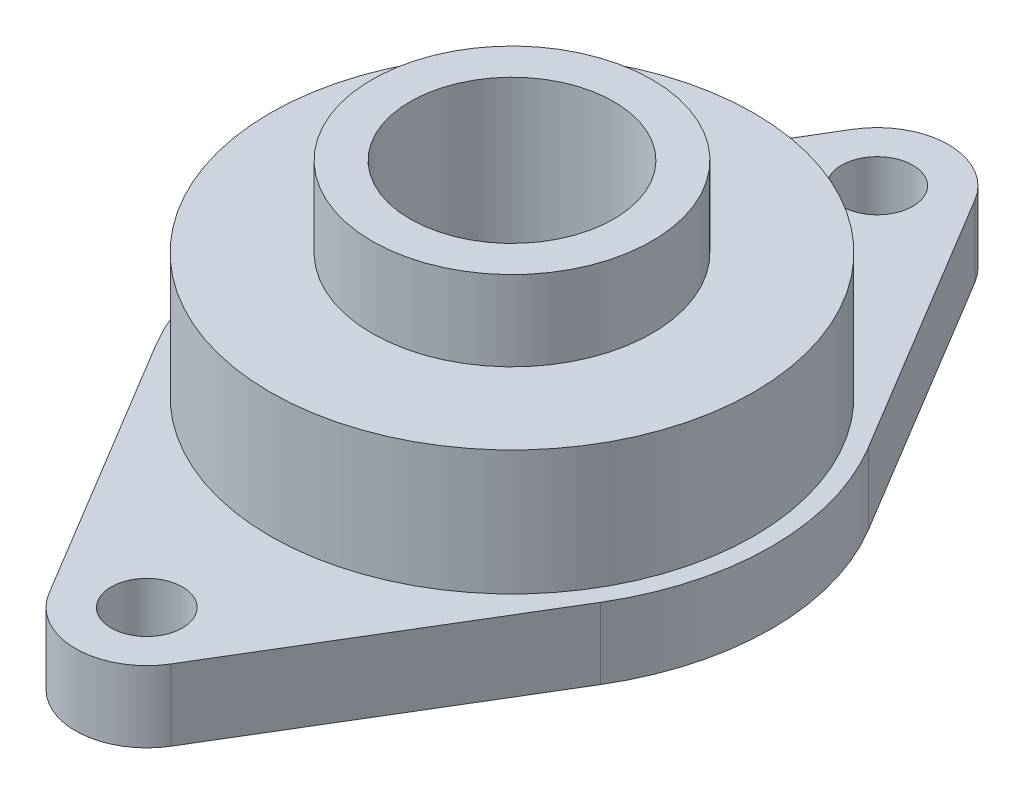
ISO-10303-21;
HEADER;
FILE_DESCRIPTION(('STEP AP214'),'2;1');
FILE_NAME('part.step','',(''),(''),'','','');
FILE_SCHEMA(('AUTOMOTIVE_DESIGN { 1 0 10303 214 1 1 1 1 }'));
ENDSEC;
DATA;
#1=APPLICATION_CONTEXT('core data for automotive mechanical design processes');
#2=APPLICATION_PROTOCOL_DEFINITION('international standard','automotive_design',2000,#1);
#3=PRODUCT_CONTEXT('',#1,'mechanical');
#4=PRODUCT('Part','Part','',(#3));
#5=PRODUCT_RELATED_PRODUCT_CATEGORY('part','',(#4));
#6=PRODUCT_DEFINITION_FORMATION('','',#4);
#7=PRODUCT_DEFINITION_CONTEXT('part definition',#1,'design');
#8=PRODUCT_DEFINITION('design','',#6,#7);
#9=PRODUCT_DEFINITION_SHAPE('','',#8);
#10=(LENGTH_UNIT() NAMED_UNIT(*) SI_UNIT(.MILLI.,.METRE.));
#11=(NAMED_UNIT(*) PLANE_ANGLE_UNIT() SI_UNIT($,.RADIAN.));
#12=(NAMED_UNIT(*) SI_UNIT($,.STERADIAN.) SOLID_ANGLE_UNIT());
#13=UNCERTAINTY_MEASURE_WITH_UNIT(LENGTH_MEASURE(1.E-05),#10,'distance_accuracy_value','');
#14=(GEOMETRIC_REPRESENTATION_CONTEXT(3) GLOBAL_UNCERTAINTY_ASSIGNED_CONTEXT((#13)) GLOBAL_UNIT_ASSIGNED_CONTEXT((#10,
#11,#12)) REPRESENTATION_CONTEXT('',''));
#15=CARTESIAN_POINT('',(0.,0.,0.));
#16=DIRECTION('',(0.,0.,1.));
#17=DIRECTION('',(1.,0.,0.));
#18=AXIS2_PLACEMENT_3D('',#15,#16,#17);
#19=CARTESIAN_POINT('',(0.,38.5,0.));
#20=DIRECTION('',(0.,1.,0.));
#21=DIRECTION('',(0.,0.,1.));
#22=AXIS2_PLACEMENT_3D('',#19,#20,#21);
#23=PLANE('',#22);
#24=CARTESIAN_POINT('',(0.,38.5,0.));
#25=DIRECTION('',(0.,1.,0.));
#26=DIRECTION('',(0.,0.,1.));
#27=AXIS2_PLACEMENT_3D('',#24,#25,#26);
#28=CIRCLE('',#27,47.5);
#29=CARTESIAN_POINT('',(0.,38.5,47.5));
#30=VERTEX_POINT('',#29);
#31=EDGE_CURVE('E141',#30,#30,#28,.T.);
#32=ORIENTED_EDGE('',*,*,#31,.T.);
#33=EDGE_LOOP('',(#32));
#34=FACE_BOUND('',#33,.T.);
#35=CARTESIAN_POINT('',(0.,38.5,0.));
#36=DIRECTION('',(0.,1.,0.));
#37=DIRECTION('',(0.,0.,1.));
#38=AXIS2_PLACEMENT_3D('',#35,#36,#37);
#39=CIRCLE('',#38,27.5);
#40=CARTESIAN_POINT('',(0.,38.5,27.5));
#41=VERTEX_POINT('',#40);
#42=EDGE_CURVE('E206',#41,#41,#39,.T.);
#43=ORIENTED_EDGE('',*,*,#42,.F.);
#44=EDGE_LOOP('',(#43));
#45=FACE_BOUND('',#44,.T.);
#46=ADVANCED_FACE('F35',(#34,#45),#23,.T.);
#47=CARTESIAN_POINT('',(0.,14.,0.));
#48=DIRECTION('',(0.,1.,0.));
#49=DIRECTION('',(0.,0.,1.));
#50=AXIS2_PLACEMENT_3D('',#47,#48,#49);
#51=PLANE('',#50);
#52=CARTESIAN_POINT('',(0.,14.,71.75));
#53=DIRECTION('',(0.,1.,0.));
#54=DIRECTION('',(0.,0.,1.));
#55=AXIS2_PLACEMENT_3D('',#52,#53,#54);
#56=CIRCLE('',#55,6.99999999999999);
#57=CARTESIAN_POINT('',(0.,14.,78.75));
#58=VERTEX_POINT('',#57);
#59=EDGE_CURVE('E134',#58,#58,#56,.F.);
#60=ORIENTED_EDGE('',*,*,#59,.T.);
#61=EDGE_LOOP('',(#60));
#62=FACE_BOUND('',#61,.T.);
#63=CARTESIAN_POINT('',(0.,14.,-71.75));
#64=DIRECTION('',(0.,1.,0.));
#65=DIRECTION('',(0.,0.,1.));
#66=AXIS2_PLACEMENT_3D('',#63,#64,#65);
#67=CIRCLE('',#66,7.);
#68=CARTESIAN_POINT('',(0.,14.,-64.75));
#69=VERTEX_POINT('',#68);
#70=EDGE_CURVE('E127',#69,#69,#67,.T.);
#71=ORIENTED_EDGE('',*,*,#70,.F.);
#72=EDGE_LOOP('',(#71));
#73=FACE_BOUND('',#72,.T.);
#74=DIRECTION('',(0.51567944250871,0.,0.856781601444561));
#75=VECTOR('',#74,1.);
#76=CARTESIAN_POINT('',(43.6958616736726,14.,-26.2996515679442));
#77=LINE('',#76,#75);
#78=CARTESIAN_POINT('',(11.9949424202239,14.,-78.9695121951219));
#79=VERTEX_POINT('',#78);
#80=CARTESIAN_POINT('',(43.6958616736726,14.,-26.2996515679442));
#81=VERTEX_POINT('',#80);
#82=EDGE_CURVE('E163',#79,#81,#77,.T.);
#83=ORIENTED_EDGE('',*,*,#82,.F.);
#84=CARTESIAN_POINT('',(0.,14.,-71.75));
#85=DIRECTION('',(0.,1.,0.));
#86=DIRECTION('',(0.,0.,1.));
#87=AXIS2_PLACEMENT_3D('',#84,#85,#86);
#88=CIRCLE('',#87,14.);
#89=CARTESIAN_POINT('',(-11.9949424202239,14.,-78.9695121951219));
#90=VERTEX_POINT('',#89);
#91=EDGE_CURVE('E194',#79,#90,#88,.T.);
#92=ORIENTED_EDGE('',*,*,#91,.T.);
#93=DIRECTION('',(0.515679442508711,0.,-0.85678160144456));
#94=VECTOR('',#93,1.);
#95=CARTESIAN_POINT('',(-43.6958616736726,14.,-26.2996515679443));
#96=LINE('',#95,#94);
#97=CARTESIAN_POINT('',(-43.6958616736726,14.,-26.2996515679442));
#98=VERTEX_POINT('',#97);
#99=EDGE_CURVE('E177',#98,#90,#96,.T.);
#100=ORIENTED_EDGE('',*,*,#99,.F.);
#101=CARTESIAN_POINT('',(0.,14.,0.));
#102=DIRECTION('',(0.,1.,0.));
#103=DIRECTION('',(0.,0.,1.));
#104=AXIS2_PLACEMENT_3D('',#101,#102,#103);
#105=CIRCLE('',#104,51.);
#106=CARTESIAN_POINT('',(-43.6958616736726,14.,26.2996515679442));
#107=VERTEX_POINT('',#106);
#108=EDGE_CURVE('E129',#98,#107,#105,.T.);
#109=ORIENTED_EDGE('',*,*,#108,.T.);
#110=DIRECTION('',(0.515679442508711,0.,0.85678160144456));
#111=VECTOR('',#110,1.);
#112=CARTESIAN_POINT('',(-43.6958616736726,14.,26.2996515679443));
#113=LINE('',#112,#111);
#114=CARTESIAN_POINT('',(-11.9949424202239,14.,78.9695121951219));
#115=VERTEX_POINT('',#114);
#116=EDGE_CURVE('E113',#107,#115,#113,.T.);
#117=ORIENTED_EDGE('',*,*,#116,.T.);
#118=CARTESIAN_POINT('',(0.,14.,71.75));
#119=DIRECTION('',(0.,1.,0.));
#120=DIRECTION('',(0.,0.,1.));
#121=AXIS2_PLACEMENT_3D('',#118,#119,#120);
#122=CIRCLE('',#121,14.);
#123=CARTESIAN_POINT('',(11.9949424202239,14.,78.9695121951219));
#124=VERTEX_POINT('',#123);
#125=EDGE_CURVE('E106',#115,#124,#122,.T.);
#126=ORIENTED_EDGE('',*,*,#125,.T.);
#127=DIRECTION('',(0.51567944250871,0.,-0.856781601444561));
#128=VECTOR('',#127,1.);
#129=CARTESIAN_POINT('',(43.6958616736726,14.,26.2996515679442));
#130=LINE('',#129,#128);
#131=CARTESIAN_POINT('',(43.6958616736726,14.,26.2996515679442));
#132=VERTEX_POINT('',#131);
#133=EDGE_CURVE('E111',#124,#132,#130,.T.);
#134=ORIENTED_EDGE('',*,*,#133,.T.);
#135=EDGE_CURVE('E52',#132,#81,#105,.T.);
#136=ORIENTED_EDGE('',*,*,#135,.T.);
#137=EDGE_LOOP('',(#83,#92,#100,#109,#117,#126,#134,#136));
#138=FACE_BOUND('',#137,.T.);
#139=CARTESIAN_POINT('',(0.,14.,0.));
#140=DIRECTION('',(0.,1.,0.));
#141=DIRECTION('',(0.,0.,1.));
#142=AXIS2_PLACEMENT_3D('',#139,#140,#141);
#143=CIRCLE('',#142,47.5);
#144=CARTESIAN_POINT('',(0.,14.,47.5));
#145=VERTEX_POINT('',#144);
#146=EDGE_CURVE('E197',#145,#145,#143,.T.);
#147=ORIENTED_EDGE('',*,*,#146,.F.);
#148=EDGE_LOOP('',(#147));
#149=FACE_BOUND('',#148,.T.);
#150=ADVANCED_FACE('F108',(#62,#73,#138,#149),#51,.T.);
#151=CARTESIAN_POINT('',(43.6958616736726,14.,-26.2996515679442));
#152=DIRECTION('',(0.856781601444561,0.,-0.51567944250871));
#153=DIRECTION('',(-0.51567944250871,0.,-0.856781601444561));
#154=AXIS2_PLACEMENT_3D('',#151,#152,#153);
#155=PLANE('',#154);
#156=DIRECTION('',(0.51567944250871,0.,0.856781601444561));
#157=VECTOR('',#156,1.);
#158=CARTESIAN_POINT('',(43.6958616736726,0.,-26.2996515679442));
#159=LINE('',#158,#157);
#160=CARTESIAN_POINT('',(11.9949424202239,0.,-78.9695121951219));
#161=VERTEX_POINT('',#160);
#162=CARTESIAN_POINT('',(43.6958616736726,0.,-26.2996515679442));
#163=VERTEX_POINT('',#162);
#164=EDGE_CURVE('E137',#161,#163,#159,.T.);
#165=ORIENTED_EDGE('',*,*,#164,.F.);
#166=DIRECTION('',(0.,-1.,0.));
#167=VECTOR('',#166,1.);
#168=CARTESIAN_POINT('',(11.9949424202239,14.,-78.9695121951219));
#169=LINE('',#168,#167);
#170=EDGE_CURVE('E12',#79,#161,#169,.T.);
#171=ORIENTED_EDGE('',*,*,#170,.F.);
#172=ORIENTED_EDGE('',*,*,#82,.T.);
#173=DIRECTION('',(0.,-1.,0.));
#174=VECTOR('',#173,1.);
#175=CARTESIAN_POINT('',(43.6958616736726,14.,-26.2996515679442));
#176=LINE('',#175,#174);
#177=EDGE_CURVE('E87',#81,#163,#176,.T.);
#178=ORIENTED_EDGE('',*,*,#177,.T.);
#179=EDGE_LOOP('',(#165,#171,#172,#178));
#180=FACE_BOUND('',#179,.T.);
#181=ADVANCED_FACE('F37',(#180),#155,.T.);
#182=CARTESIAN_POINT('',(0.,14.,-71.75));
#183=DIRECTION('',(0.,-1.,0.));
#184=DIRECTION('',(0.,0.,-1.));
#185=AXIS2_PLACEMENT_3D('',#182,#183,#184);
#186=CYLINDRICAL_SURFACE('',#185,14.);
#187=CARTESIAN_POINT('',(0.,0.,-71.75));
#188=DIRECTION('',(0.,1.,0.));
#189=DIRECTION('',(0.,0.,1.));
#190=AXIS2_PLACEMENT_3D('',#187,#188,#189);
#191=CIRCLE('',#190,14.);
#192=CARTESIAN_POINT('',(-11.9949424202239,0.,-78.9695121951219));
#193=VERTEX_POINT('',#192);
#194=EDGE_CURVE('E140',#161,#193,#191,.T.);
#195=ORIENTED_EDGE('',*,*,#194,.T.);
#196=DIRECTION('',(0.,-1.,0.));
#197=VECTOR('',#196,1.);
#198=CARTESIAN_POINT('',(-11.9949424202239,14.,-78.9695121951219));
#199=LINE('',#198,#197);
#200=EDGE_CURVE('E44',#90,#193,#199,.T.);
#201=ORIENTED_EDGE('',*,*,#200,.F.);
#202=ORIENTED_EDGE('',*,*,#91,.F.);
#203=ORIENTED_EDGE('',*,*,#170,.T.);
#204=EDGE_LOOP('',(#195,#201,#202,#203));
#205=FACE_BOUND('',#204,.T.);
#206=ADVANCED_FACE('F180',(#205),#186,.T.);
#207=CARTESIAN_POINT('',(-43.6958616736726,14.,-26.2996515679443));
#208=DIRECTION('',(-0.85678160144456,0.,-0.515679442508711));
#209=DIRECTION('',(-0.515679442508711,0.,0.85678160144456));
#210=AXIS2_PLACEMENT_3D('',#207,#208,#209);
#211=PLANE('',#210);
#212=DIRECTION('',(0.515679442508711,0.,-0.85678160144456));
#213=VECTOR('',#212,1.);
#214=CARTESIAN_POINT('',(-43.6958616736726,0.,-26.2996515679443));
#215=LINE('',#214,#213);
#216=CARTESIAN_POINT('',(-43.6958616736726,0.,-26.2996515679442));
#217=VERTEX_POINT('',#216);
#218=EDGE_CURVE('E144',#217,#193,#215,.T.);
#219=ORIENTED_EDGE('',*,*,#218,.F.);
#220=DIRECTION('',(0.,-1.,0.));
#221=VECTOR('',#220,1.);
#222=CARTESIAN_POINT('',(-43.6958616736726,14.,-26.2996515679442));
#223=LINE('',#222,#221);
#224=EDGE_CURVE('E170',#98,#217,#223,.T.);
#225=ORIENTED_EDGE('',*,*,#224,.F.);
#226=ORIENTED_EDGE('',*,*,#99,.T.);
#227=ORIENTED_EDGE('',*,*,#200,.T.);
#228=EDGE_LOOP('',(#219,#225,#226,#227));
#229=FACE_BOUND('',#228,.T.);
#230=ADVANCED_FACE('F175',(#229),#211,.T.);
#231=CARTESIAN_POINT('',(0.,14.,0.));
#232=DIRECTION('',(0.,-1.,0.));
#233=DIRECTION('',(0.,0.,-1.));
#234=AXIS2_PLACEMENT_3D('',#231,#232,#233);
#235=CYLINDRICAL_SURFACE('',#234,51.);
#236=CARTESIAN_POINT('',(0.,0.,0.));
#237=DIRECTION('',(0.,1.,0.));
#238=DIRECTION('',(0.,0.,1.));
#239=AXIS2_PLACEMENT_3D('',#236,#237,#238);
#240=CIRCLE('',#239,51.);
#241=CARTESIAN_POINT('',(-43.6958616736726,0.,26.2996515679442));
#242=VERTEX_POINT('',#241);
#243=EDGE_CURVE('E147',#217,#242,#240,.T.);
#244=ORIENTED_EDGE('',*,*,#243,.T.);
#245=DIRECTION('',(0.,-1.,0.));
#246=VECTOR('',#245,1.);
#247=CARTESIAN_POINT('',(-43.6958616736726,14.,26.2996515679442));
#248=LINE('',#247,#246);
#249=EDGE_CURVE('E167',#107,#242,#248,.T.);
#250=ORIENTED_EDGE('',*,*,#249,.F.);
#251=ORIENTED_EDGE('',*,*,#108,.F.);
#252=ORIENTED_EDGE('',*,*,#224,.T.);
#253=EDGE_LOOP('',(#244,#250,#251,#252));
#254=FACE_BOUND('',#253,.T.);
#255=ADVANCED_FACE('F188',(#254),#235,.T.);
#256=CARTESIAN_POINT('',(-43.6958616736726,14.,26.2996515679443));
#257=DIRECTION('',(0.85678160144456,0.,-0.515679442508711));
#258=DIRECTION('',(-0.515679442508711,0.,-0.85678160144456));
#259=AXIS2_PLACEMENT_3D('',#256,#257,#258);
#260=PLANE('',#259);
#261=DIRECTION('',(0.515679442508711,0.,0.85678160144456));
#262=VECTOR('',#261,1.);
#263=CARTESIAN_POINT('',(-43.6958616736726,0.,26.2996515679443));
#264=LINE('',#263,#262);
#265=CARTESIAN_POINT('',(-11.9949424202239,0.,78.9695121951219));
#266=VERTEX_POINT('',#265);
#267=EDGE_CURVE('E149',#242,#266,#264,.T.);
#268=ORIENTED_EDGE('',*,*,#267,.T.);
#269=DIRECTION('',(0.,-1.,0.));
#270=VECTOR('',#269,1.);
#271=CARTESIAN_POINT('',(-11.9949424202239,14.,78.9695121951219));
#272=LINE('',#271,#270);
#273=EDGE_CURVE('E122',#115,#266,#272,.T.);
#274=ORIENTED_EDGE('',*,*,#273,.F.);
#275=ORIENTED_EDGE('',*,*,#116,.F.);
#276=ORIENTED_EDGE('',*,*,#249,.T.);
#277=EDGE_LOOP('',(#268,#274,#275,#276));
#278=FACE_BOUND('',#277,.T.);
#279=ADVANCED_FACE('F191',(#278),#260,.F.);
#280=CARTESIAN_POINT('',(0.,14.,71.75));
#281=DIRECTION('',(0.,-1.,0.));
#282=DIRECTION('',(0.,0.,-1.));
#283=AXIS2_PLACEMENT_3D('',#280,#281,#282);
#284=CYLINDRICAL_SURFACE('',#283,14.);
#285=CARTESIAN_POINT('',(0.,0.,71.75));
#286=DIRECTION('',(0.,1.,0.));
#287=DIRECTION('',(0.,0.,1.));
#288=AXIS2_PLACEMENT_3D('',#285,#286,#287);
#289=CIRCLE('',#288,14.);
#290=CARTESIAN_POINT('',(11.9949424202239,0.,78.9695121951219));
#291=VERTEX_POINT('',#290);
#292=EDGE_CURVE('E121',#266,#291,#289,.T.);
#293=ORIENTED_EDGE('',*,*,#292,.T.);
#294=DIRECTION('',(0.,-1.,0.));
#295=VECTOR('',#294,1.);
#296=CARTESIAN_POINT('',(11.9949424202239,14.,78.9695121951219));
#297=LINE('',#296,#295);
#298=EDGE_CURVE('E118',#124,#291,#297,.T.);
#299=ORIENTED_EDGE('',*,*,#298,.F.);
#300=ORIENTED_EDGE('',*,*,#125,.F.);
#301=ORIENTED_EDGE('',*,*,#273,.T.);
#302=EDGE_LOOP('',(#293,#299,#300,#301));
#303=FACE_BOUND('',#302,.T.);
#304=ADVANCED_FACE('F119',(#303),#284,.T.);
#305=CARTESIAN_POINT('',(43.6958616736726,14.,26.2996515679442));
#306=DIRECTION('',(-0.856781601444561,0.,-0.51567944250871));
#307=DIRECTION('',(-0.51567944250871,0.,0.856781601444561));
#308=AXIS2_PLACEMENT_3D('',#305,#306,#307);
#309=PLANE('',#308);
#310=DIRECTION('',(0.51567944250871,0.,-0.856781601444561));
#311=VECTOR('',#310,1.);
#312=CARTESIAN_POINT('',(43.6958616736726,0.,26.2996515679442));
#313=LINE('',#312,#311);
#314=CARTESIAN_POINT('',(43.6958616736726,0.,26.2996515679442));
#315=VERTEX_POINT('',#314);
#316=EDGE_CURVE('E80',#291,#315,#313,.T.);
#317=ORIENTED_EDGE('',*,*,#316,.T.);
#318=DIRECTION('',(0.,-1.,0.));
#319=VECTOR('',#318,1.);
#320=CARTESIAN_POINT('',(43.6958616736726,14.,26.2996515679442));
#321=LINE('',#320,#319);
#322=EDGE_CURVE('E123',#132,#315,#321,.T.);
#323=ORIENTED_EDGE('',*,*,#322,.F.);
#324=ORIENTED_EDGE('',*,*,#133,.F.);
#325=ORIENTED_EDGE('',*,*,#298,.T.);
#326=EDGE_LOOP('',(#317,#323,#324,#325));
#327=FACE_BOUND('',#326,.T.);
#328=ADVANCED_FACE('F125',(#327),#309,.F.);
#329=CARTESIAN_POINT('',(0.,14.,0.));
#330=DIRECTION('',(0.,-1.,0.));
#331=DIRECTION('',(0.,0.,-1.));
#332=AXIS2_PLACEMENT_3D('',#329,#330,#331);
#333=CYLINDRICAL_SURFACE('',#332,20.);
#334=CARTESIAN_POINT('',(0.,0.,0.));
#335=DIRECTION('',(0.,1.,0.));
#336=DIRECTION('',(0.,0.,1.));
#337=AXIS2_PLACEMENT_3D('',#334,#335,#336);
#338=CIRCLE('',#337,20.);
#339=CARTESIAN_POINT('',(0.,0.,20.));
#340=VERTEX_POINT('',#339);
#341=EDGE_CURVE('E157',#340,#340,#338,.T.);
#342=ORIENTED_EDGE('',*,*,#341,.F.);
#343=EDGE_LOOP('',(#342));
#344=FACE_BOUND('',#343,.T.);
#345=CARTESIAN_POINT('',(0.,54.2,0.));
#346=DIRECTION('',(0.,1.,0.));
#347=DIRECTION('',(0.,0.,1.));
#348=AXIS2_PLACEMENT_3D('',#345,#346,#347);
#349=CIRCLE('',#348,20.);
#350=CARTESIAN_POINT('',(0.,54.2,20.));
#351=VERTEX_POINT('',#350);
#352=EDGE_CURVE('E203',#351,#351,#349,.T.);
#353=ORIENTED_EDGE('',*,*,#352,.T.);
#354=EDGE_LOOP('',(#353));
#355=FACE_BOUND('',#354,.T.);
#356=ADVANCED_FACE('F244',(#344,#355),#333,.F.);
#357=CARTESIAN_POINT('',(0.,14.,-71.75));
#358=DIRECTION('',(0.,-1.,0.));
#359=DIRECTION('',(0.,0.,-1.));
#360=AXIS2_PLACEMENT_3D('',#357,#358,#359);
#361=CYLINDRICAL_SURFACE('',#360,7.);
#362=ORIENTED_EDGE('',*,*,#70,.T.);
#363=EDGE_LOOP('',(#362));
#364=FACE_BOUND('',#363,.T.);
#365=CARTESIAN_POINT('',(0.,0.,-71.75));
#366=DIRECTION('',(0.,1.,0.));
#367=DIRECTION('',(0.,0.,1.));
#368=AXIS2_PLACEMENT_3D('',#365,#366,#367);
#369=CIRCLE('',#368,7.);
#370=CARTESIAN_POINT('',(0.,0.,-64.75));
#371=VERTEX_POINT('',#370);
#372=EDGE_CURVE('E154',#371,#371,#369,.T.);
#373=ORIENTED_EDGE('',*,*,#372,.F.);
#374=EDGE_LOOP('',(#373));
#375=FACE_BOUND('',#374,.T.);
#376=ADVANCED_FACE('F247',(#364,#375),#361,.F.);
#377=EDGE_CURVE('E150',#315,#163,#240,.T.);
#378=ORIENTED_EDGE('',*,*,#377,.T.);
#379=ORIENTED_EDGE('',*,*,#177,.F.);
#380=ORIENTED_EDGE('',*,*,#135,.F.);
#381=ORIENTED_EDGE('',*,*,#322,.T.);
#382=EDGE_LOOP('',(#378,#379,#380,#381));
#383=FACE_BOUND('',#382,.T.);
#384=ADVANCED_FACE('F242',(#383),#235,.T.);
#385=CARTESIAN_POINT('',(0.,14.,71.75));
#386=DIRECTION('',(0.,-1.,0.));
#387=DIRECTION('',(0.,0.,-1.));
#388=AXIS2_PLACEMENT_3D('',#385,#386,#387);
#389=CYLINDRICAL_SURFACE('',#388,6.99999999999999);
#390=ORIENTED_EDGE('',*,*,#59,.F.);
#391=EDGE_LOOP('',(#390));
#392=FACE_BOUND('',#391,.T.);
#393=CARTESIAN_POINT('',(0.,0.,71.75));
#394=DIRECTION('',(0.,1.,0.));
#395=DIRECTION('',(0.,0.,1.));
#396=AXIS2_PLACEMENT_3D('',#393,#394,#395);
#397=CIRCLE('',#396,6.99999999999999);
#398=CARTESIAN_POINT('',(0.,0.,78.75));
#399=VERTEX_POINT('',#398);
#400=EDGE_CURVE('E160',#399,#399,#397,.F.);
#401=ORIENTED_EDGE('',*,*,#400,.T.);
#402=EDGE_LOOP('',(#401));
#403=FACE_BOUND('',#402,.T.);
#404=ADVANCED_FACE('F239',(#392,#403),#389,.F.);
#405=CARTESIAN_POINT('',(0.,0.,0.));
#406=DIRECTION('',(0.,1.,0.));
#407=DIRECTION('',(0.,0.,1.));
#408=AXIS2_PLACEMENT_3D('',#405,#406,#407);
#409=PLANE('',#408);
#410=ORIENTED_EDGE('',*,*,#164,.T.);
#411=ORIENTED_EDGE('',*,*,#377,.F.);
#412=ORIENTED_EDGE('',*,*,#316,.F.);
#413=ORIENTED_EDGE('',*,*,#292,.F.);
#414=ORIENTED_EDGE('',*,*,#267,.F.);
#415=ORIENTED_EDGE('',*,*,#243,.F.);
#416=ORIENTED_EDGE('',*,*,#218,.T.);
#417=ORIENTED_EDGE('',*,*,#194,.F.);
#418=EDGE_LOOP('',(#410,#411,#412,#413,#414,#415,#416,#417));
#419=FACE_BOUND('',#418,.T.);
#420=ORIENTED_EDGE('',*,*,#372,.T.);
#421=EDGE_LOOP('',(#420));
#422=FACE_BOUND('',#421,.T.);
#423=ORIENTED_EDGE('',*,*,#341,.T.);
#424=EDGE_LOOP('',(#423));
#425=FACE_BOUND('',#424,.T.);
#426=ORIENTED_EDGE('',*,*,#400,.F.);
#427=EDGE_LOOP('',(#426));
#428=FACE_BOUND('',#427,.T.);
#429=ADVANCED_FACE('F183',(#419,#422,#425,#428),#409,.F.);
#430=CARTESIAN_POINT('',(0.,211.350288425444,0.));
#431=DIRECTION('',(0.,-1.,0.));
#432=DIRECTION('',(0.,0.,-1.));
#433=AXIS2_PLACEMENT_3D('',#430,#431,#432);
#434=CYLINDRICAL_SURFACE('',#433,47.5);
#435=ORIENTED_EDGE('',*,*,#146,.T.);
#436=EDGE_LOOP('',(#435));
#437=FACE_BOUND('',#436,.T.);
#438=ORIENTED_EDGE('',*,*,#31,.F.);
#439=EDGE_LOOP('',(#438));
#440=FACE_BOUND('',#439,.T.);
#441=ADVANCED_FACE('F216',(#437,#440),#434,.T.);
#442=CARTESIAN_POINT('',(0.,186.18174593052,0.));
#443=DIRECTION('',(0.,-1.,0.));
#444=DIRECTION('',(0.,0.,-1.));
#445=AXIS2_PLACEMENT_3D('',#442,#443,#444);
#446=CYLINDRICAL_SURFACE('',#445,27.5);
#447=ORIENTED_EDGE('',*,*,#42,.T.);
#448=EDGE_LOOP('',(#447));
#449=FACE_BOUND('',#448,.T.);
#450=CARTESIAN_POINT('',(0.,54.2,0.));
#451=DIRECTION('',(0.,1.,0.));
#452=DIRECTION('',(0.,0.,1.));
#453=AXIS2_PLACEMENT_3D('',#450,#451,#452);
#454=CIRCLE('',#453,27.5);
#455=CARTESIAN_POINT('',(0.,54.2,27.5));
#456=VERTEX_POINT('',#455);
#457=EDGE_CURVE('E200',#456,#456,#454,.T.);
#458=ORIENTED_EDGE('',*,*,#457,.F.);
#459=EDGE_LOOP('',(#458));
#460=FACE_BOUND('',#459,.T.);
#461=ADVANCED_FACE('F214',(#449,#460),#446,.T.);
#462=CARTESIAN_POINT('',(0.,54.2,0.));
#463=DIRECTION('',(0.,1.,0.));
#464=DIRECTION('',(0.,0.,1.));
#465=AXIS2_PLACEMENT_3D('',#462,#463,#464);
#466=PLANE('',#465);
#467=ORIENTED_EDGE('',*,*,#352,.F.);
#468=EDGE_LOOP('',(#467));
#469=FACE_BOUND('',#468,.T.);
#470=ORIENTED_EDGE('',*,*,#457,.T.);
#471=EDGE_LOOP('',(#470));
#472=FACE_BOUND('',#471,.T.);
#473=ADVANCED_FACE('F212',(#469,#472),#466,.T.);
#474=CLOSED_SHELL('',(#46,#150,#181,#206,#230,#255,#279,#304,#328,#356,#376,#384,#404,#429,#441,
#461,#473));
#475=MANIFOLD_SOLID_BREP('B2',#474);
#476=ADVANCED_BREP_SHAPE_REPRESENTATION('',(#18,#475),#14);
#477=SHAPE_DEFINITION_REPRESENTATION(#9,#476);
ENDSEC;
END-ISO-10303-21;
